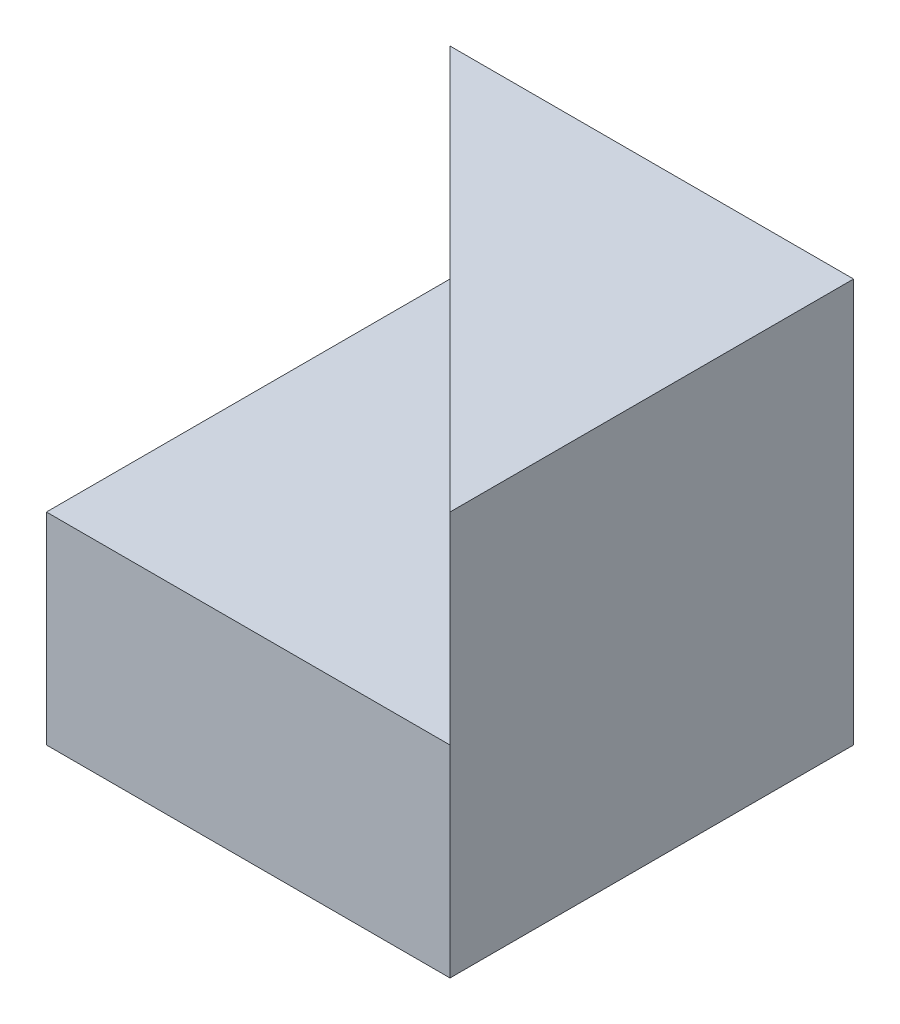
ISO-10303-21;
HEADER;
FILE_DESCRIPTION(('STEP AP214'),'2;1');
FILE_NAME('part.step','',(''),(''),'','','');
FILE_SCHEMA(('AUTOMOTIVE_DESIGN { 1 0 10303 214 1 1 1 1 }'));
ENDSEC;
DATA;
#1=APPLICATION_CONTEXT('core data for automotive mechanical design processes');
#2=APPLICATION_PROTOCOL_DEFINITION('international standard','automotive_design',2000,#1);
#3=PRODUCT_CONTEXT('',#1,'mechanical');
#4=PRODUCT('Part','Part','',(#3));
#5=PRODUCT_RELATED_PRODUCT_CATEGORY('part','',(#4));
#6=PRODUCT_DEFINITION_FORMATION('','',#4);
#7=PRODUCT_DEFINITION_CONTEXT('part definition',#1,'design');
#8=PRODUCT_DEFINITION('design','',#6,#7);
#9=PRODUCT_DEFINITION_SHAPE('','',#8);
#10=(LENGTH_UNIT() NAMED_UNIT(*) SI_UNIT(.MILLI.,.METRE.));
#11=(NAMED_UNIT(*) PLANE_ANGLE_UNIT() SI_UNIT($,.RADIAN.));
#12=(NAMED_UNIT(*) SI_UNIT($,.STERADIAN.) SOLID_ANGLE_UNIT());
#13=UNCERTAINTY_MEASURE_WITH_UNIT(LENGTH_MEASURE(1.E-05),#10,'distance_accuracy_value','');
#14=(GEOMETRIC_REPRESENTATION_CONTEXT(3) GLOBAL_UNCERTAINTY_ASSIGNED_CONTEXT((#13)) GLOBAL_UNIT_ASSIGNED_CONTEXT((#10,
#11,#12)) REPRESENTATION_CONTEXT('',''));
#15=CARTESIAN_POINT('',(0.,0.,0.));
#16=DIRECTION('',(0.,0.,1.));
#17=DIRECTION('',(1.,0.,0.));
#18=AXIS2_PLACEMENT_3D('',#15,#16,#17);
#19=CARTESIAN_POINT('',(0.,0.,40.));
#20=DIRECTION('',(1.,0.,0.));
#21=DIRECTION('',(0.,0.,-1.));
#22=AXIS2_PLACEMENT_3D('',#19,#20,#21);
#23=PLANE('',#22);
#24=DIRECTION('',(0.,0.,1.));
#25=VECTOR('',#24,1.);
#26=CARTESIAN_POINT('',(0.,20.,40.));
#27=LINE('',#26,#25);
#28=CARTESIAN_POINT('',(0.,20.,0.));
#29=VERTEX_POINT('',#28);
#30=CARTESIAN_POINT('',(0.,20.,40.));
#31=VERTEX_POINT('',#30);
#32=EDGE_CURVE('E84',#29,#31,#27,.T.);
#33=ORIENTED_EDGE('',*,*,#32,.F.);
#34=DIRECTION('',(0.,-1.,0.));
#35=VECTOR('',#34,1.);
#36=CARTESIAN_POINT('',(0.,0.,0.));
#37=LINE('',#36,#35);
#38=CARTESIAN_POINT('',(0.,0.,0.));
#39=VERTEX_POINT('',#38);
#40=EDGE_CURVE('E96',#29,#39,#37,.T.);
#41=ORIENTED_EDGE('',*,*,#40,.T.);
#42=DIRECTION('',(0.,0.,-1.));
#43=VECTOR('',#42,1.);
#44=CARTESIAN_POINT('',(0.,0.,40.));
#45=LINE('',#44,#43);
#46=CARTESIAN_POINT('',(0.,0.,40.));
#47=VERTEX_POINT('',#46);
#48=EDGE_CURVE('E11',#47,#39,#45,.T.);
#49=ORIENTED_EDGE('',*,*,#48,.F.);
#50=DIRECTION('',(0.,-1.,0.));
#51=VECTOR('',#50,1.);
#52=CARTESIAN_POINT('',(0.,0.,40.));
#53=LINE('',#52,#51);
#54=EDGE_CURVE('E91',#31,#47,#53,.T.);
#55=ORIENTED_EDGE('',*,*,#54,.F.);
#56=EDGE_LOOP('',(#33,#41,#49,#55));
#57=FACE_BOUND('',#56,.T.);
#58=ADVANCED_FACE('F33',(#57),#23,.F.);
#59=CARTESIAN_POINT('',(0.,0.,40.));
#60=DIRECTION('',(0.,0.,-1.));
#61=DIRECTION('',(-1.,0.,0.));
#62=AXIS2_PLACEMENT_3D('',#59,#60,#61);
#63=PLANE('',#62);
#64=DIRECTION('',(1.,0.,0.));
#65=VECTOR('',#64,1.);
#66=CARTESIAN_POINT('',(40.,20.,40.));
#67=LINE('',#66,#65);
#68=CARTESIAN_POINT('',(40.,20.,40.));
#69=VERTEX_POINT('',#68);
#70=EDGE_CURVE('E120',#31,#69,#67,.T.);
#71=ORIENTED_EDGE('',*,*,#70,.F.);
#72=ORIENTED_EDGE('',*,*,#54,.T.);
#73=DIRECTION('',(1.,0.,0.));
#74=VECTOR('',#73,1.);
#75=CARTESIAN_POINT('',(0.,0.,40.));
#76=LINE('',#75,#74);
#77=CARTESIAN_POINT('',(40.,0.,40.));
#78=VERTEX_POINT('',#77);
#79=EDGE_CURVE('E49',#47,#78,#76,.T.);
#80=ORIENTED_EDGE('',*,*,#79,.T.);
#81=DIRECTION('',(0.,1.,0.));
#82=VECTOR('',#81,1.);
#83=CARTESIAN_POINT('',(40.,0.,40.));
#84=LINE('',#83,#82);
#85=EDGE_CURVE('E101',#78,#69,#84,.T.);
#86=ORIENTED_EDGE('',*,*,#85,.T.);
#87=EDGE_LOOP('',(#71,#72,#80,#86));
#88=FACE_BOUND('',#87,.T.);
#89=ADVANCED_FACE('F127',(#88),#63,.F.);
#90=CARTESIAN_POINT('',(0.,0.,40.));
#91=DIRECTION('',(0.,1.,0.));
#92=DIRECTION('',(0.,0.,1.));
#93=AXIS2_PLACEMENT_3D('',#90,#91,#92);
#94=PLANE('',#93);
#95=DIRECTION('',(1.,0.,0.));
#96=VECTOR('',#95,1.);
#97=CARTESIAN_POINT('',(0.,0.,0.));
#98=LINE('',#97,#96);
#99=CARTESIAN_POINT('',(40.,0.,0.));
#100=VERTEX_POINT('',#99);
#101=EDGE_CURVE('E97',#39,#100,#98,.T.);
#102=ORIENTED_EDGE('',*,*,#101,.T.);
#103=DIRECTION('',(0.,0.,-1.));
#104=VECTOR('',#103,1.);
#105=CARTESIAN_POINT('',(40.,0.,40.));
#106=LINE('',#105,#104);
#107=EDGE_CURVE('E41',#78,#100,#106,.T.);
#108=ORIENTED_EDGE('',*,*,#107,.F.);
#109=ORIENTED_EDGE('',*,*,#79,.F.);
#110=ORIENTED_EDGE('',*,*,#48,.T.);
#111=EDGE_LOOP('',(#102,#108,#109,#110));
#112=FACE_BOUND('',#111,.T.);
#113=ADVANCED_FACE('F109',(#112),#94,.F.);
#114=CARTESIAN_POINT('',(40.,0.,40.));
#115=DIRECTION('',(-1.,0.,0.));
#116=DIRECTION('',(0.,0.,1.));
#117=AXIS2_PLACEMENT_3D('',#114,#115,#116);
#118=PLANE('',#117);
#119=DIRECTION('',(0.,1.,0.));
#120=VECTOR('',#119,1.);
#121=CARTESIAN_POINT('',(40.,0.,0.));
#122=LINE('',#121,#120);
#123=CARTESIAN_POINT('',(40.,40.,0.));
#124=VERTEX_POINT('',#123);
#125=EDGE_CURVE('E66',#100,#124,#122,.T.);
#126=ORIENTED_EDGE('',*,*,#125,.T.);
#127=DIRECTION('',(0.,0.,-1.));
#128=VECTOR('',#127,1.);
#129=CARTESIAN_POINT('',(40.,40.,40.));
#130=LINE('',#129,#128);
#131=CARTESIAN_POINT('',(40.,40.,40.));
#132=VERTEX_POINT('',#131);
#133=EDGE_CURVE('E89',#132,#124,#130,.T.);
#134=ORIENTED_EDGE('',*,*,#133,.F.);
#135=DIRECTION('',(0.,1.,0.));
#136=VECTOR('',#135,1.);
#137=CARTESIAN_POINT('',(40.,20.,40.));
#138=LINE('',#137,#136);
#139=EDGE_CURVE('E82',#69,#132,#138,.T.);
#140=ORIENTED_EDGE('',*,*,#139,.F.);
#141=ORIENTED_EDGE('',*,*,#85,.F.);
#142=ORIENTED_EDGE('',*,*,#107,.T.);
#143=EDGE_LOOP('',(#126,#134,#140,#141,#142));
#144=FACE_BOUND('',#143,.T.);
#145=ADVANCED_FACE('F106',(#144),#118,.F.);
#146=CARTESIAN_POINT('',(0.,40.,40.));
#147=DIRECTION('',(0.,-1.,0.));
#148=DIRECTION('',(0.,0.,-1.));
#149=AXIS2_PLACEMENT_3D('',#146,#147,#148);
#150=PLANE('',#149);
#151=DIRECTION('',(-1.,0.,0.));
#152=VECTOR('',#151,1.);
#153=CARTESIAN_POINT('',(0.,40.,0.));
#154=LINE('',#153,#152);
#155=CARTESIAN_POINT('',(0.,40.,0.));
#156=VERTEX_POINT('',#155);
#157=EDGE_CURVE('E87',#124,#156,#154,.T.);
#158=ORIENTED_EDGE('',*,*,#157,.T.);
#159=DIRECTION('',(-0.707106781186548,0.,-0.707106781186548));
#160=VECTOR('',#159,1.);
#161=CARTESIAN_POINT('',(0.,40.,0.));
#162=LINE('',#161,#160);
#163=EDGE_CURVE('E73',#132,#156,#162,.T.);
#164=ORIENTED_EDGE('',*,*,#163,.F.);
#165=ORIENTED_EDGE('',*,*,#133,.T.);
#166=EDGE_LOOP('',(#158,#164,#165));
#167=FACE_BOUND('',#166,.T.);
#168=ADVANCED_FACE('F88',(#167),#150,.F.);
#169=CARTESIAN_POINT('',(0.,0.,0.));
#170=DIRECTION('',(0.,0.,-1.));
#171=DIRECTION('',(-1.,0.,0.));
#172=AXIS2_PLACEMENT_3D('',#169,#170,#171);
#173=PLANE('',#172);
#174=EDGE_CURVE('E78',#156,#29,#37,.T.);
#175=ORIENTED_EDGE('',*,*,#174,.F.);
#176=ORIENTED_EDGE('',*,*,#157,.F.);
#177=ORIENTED_EDGE('',*,*,#125,.F.);
#178=ORIENTED_EDGE('',*,*,#101,.F.);
#179=ORIENTED_EDGE('',*,*,#40,.F.);
#180=EDGE_LOOP('',(#175,#176,#177,#178,#179));
#181=FACE_BOUND('',#180,.T.);
#182=ADVANCED_FACE('F94',(#181),#173,.T.);
#183=CARTESIAN_POINT('',(0.,20.,0.));
#184=DIRECTION('',(0.707106781186548,0.,-0.707106781186548));
#185=DIRECTION('',(-0.707106781186548,0.,-0.707106781186548));
#186=AXIS2_PLACEMENT_3D('',#183,#184,#185);
#187=PLANE('',#186);
#188=ORIENTED_EDGE('',*,*,#163,.T.);
#189=ORIENTED_EDGE('',*,*,#174,.T.);
#190=DIRECTION('',(-0.707106781186548,0.,-0.707106781186548));
#191=VECTOR('',#190,1.);
#192=CARTESIAN_POINT('',(0.,20.,0.));
#193=LINE('',#192,#191);
#194=EDGE_CURVE('E122',#69,#29,#193,.T.);
#195=ORIENTED_EDGE('',*,*,#194,.F.);
#196=ORIENTED_EDGE('',*,*,#139,.T.);
#197=EDGE_LOOP('',(#188,#189,#195,#196));
#198=FACE_BOUND('',#197,.T.);
#199=ADVANCED_FACE('F75',(#198),#187,.F.);
#200=CARTESIAN_POINT('',(0.,20.,0.));
#201=DIRECTION('',(0.,1.,0.));
#202=DIRECTION('',(0.,0.,1.));
#203=AXIS2_PLACEMENT_3D('',#200,#201,#202);
#204=PLANE('',#203);
#205=ORIENTED_EDGE('',*,*,#32,.T.);
#206=ORIENTED_EDGE('',*,*,#70,.T.);
#207=ORIENTED_EDGE('',*,*,#194,.T.);
#208=EDGE_LOOP('',(#205,#206,#207));
#209=FACE_BOUND('',#208,.T.);
#210=ADVANCED_FACE('F130',(#209),#204,.T.);
#211=CLOSED_SHELL('',(#58,#89,#113,#145,#168,#182,#199,#210));
#212=MANIFOLD_SOLID_BREP('B2',#211);
#213=ADVANCED_BREP_SHAPE_REPRESENTATION('',(#18,#212),#14);
#214=SHAPE_DEFINITION_REPRESENTATION(#9,#213);
ENDSEC;
END-ISO-10303-21;
